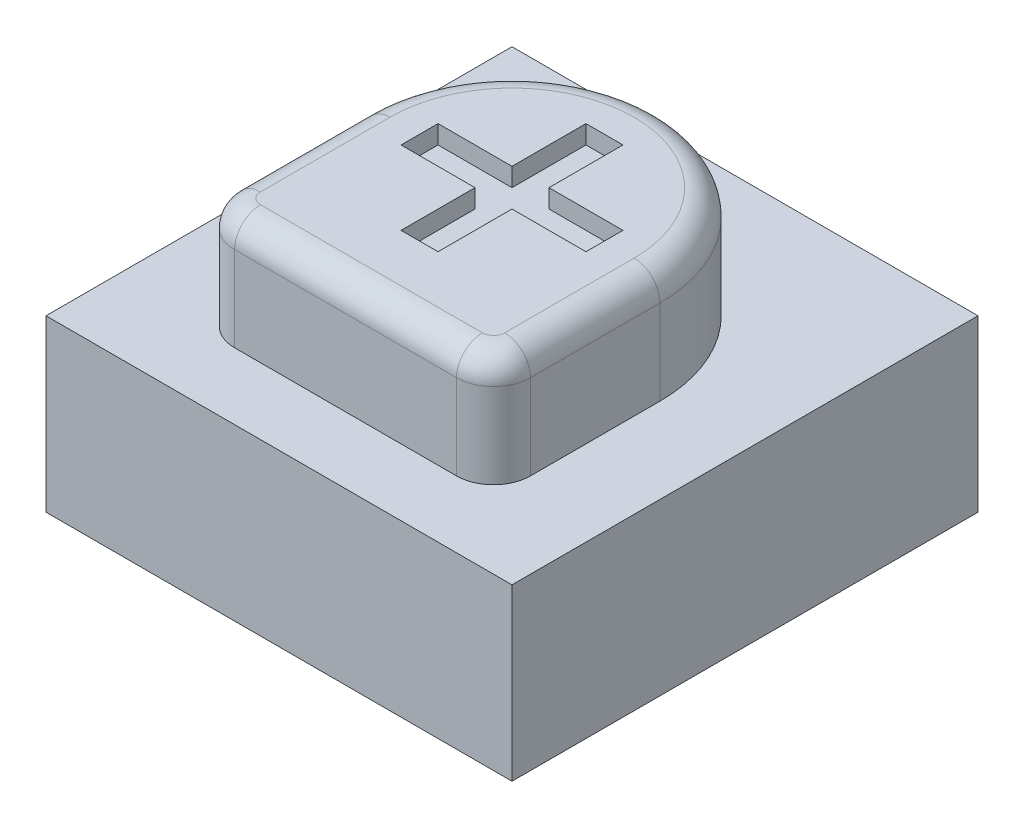
ISO-10303-21;
HEADER;
FILE_DESCRIPTION(('STEP AP214'),'2;1');
FILE_NAME('part.step','',(''),(''),'','','');
FILE_SCHEMA(('AUTOMOTIVE_DESIGN { 1 0 10303 214 1 1 1 1 }'));
ENDSEC;
DATA;
#1=APPLICATION_CONTEXT('core data for automotive mechanical design processes');
#2=APPLICATION_PROTOCOL_DEFINITION('international standard','automotive_design',2000,#1);
#3=PRODUCT_CONTEXT('',#1,'mechanical');
#4=PRODUCT('Part','Part','',(#3));
#5=PRODUCT_RELATED_PRODUCT_CATEGORY('part','',(#4));
#6=PRODUCT_DEFINITION_FORMATION('','',#4);
#7=PRODUCT_DEFINITION_CONTEXT('part definition',#1,'design');
#8=PRODUCT_DEFINITION('design','',#6,#7);
#9=PRODUCT_DEFINITION_SHAPE('','',#8);
#10=(LENGTH_UNIT() NAMED_UNIT(*) SI_UNIT(.MILLI.,.METRE.));
#11=(NAMED_UNIT(*) PLANE_ANGLE_UNIT() SI_UNIT($,.RADIAN.));
#12=(NAMED_UNIT(*) SI_UNIT($,.STERADIAN.) SOLID_ANGLE_UNIT());
#13=UNCERTAINTY_MEASURE_WITH_UNIT(LENGTH_MEASURE(1.E-05),#10,'distance_accuracy_value','');
#14=(GEOMETRIC_REPRESENTATION_CONTEXT(3) GLOBAL_UNCERTAINTY_ASSIGNED_CONTEXT((#13)) GLOBAL_UNIT_ASSIGNED_CONTEXT((#10,
#11,#12)) REPRESENTATION_CONTEXT('',''));
#15=CARTESIAN_POINT('',(0.,0.,0.));
#16=DIRECTION('',(0.,0.,1.));
#17=DIRECTION('',(1.,0.,0.));
#18=AXIS2_PLACEMENT_3D('',#15,#16,#17);
#19=CARTESIAN_POINT('',(-23.37728245926,10.197980609798,-23.63448402181));
#20=DIRECTION('',(0.,-1.,0.));
#21=DIRECTION('',(0.,0.,-1.));
#22=AXIS2_PLACEMENT_3D('',#19,#20,#21);
#23=PLANE('',#22);
#24=DIRECTION('',(-1.,0.,0.));
#25=VECTOR('',#24,1.);
#26=CARTESIAN_POINT('',(-23.37728245926,10.197980609798,-24.63448402181));
#27=LINE('',#26,#25);
#28=CARTESIAN_POINT('',(-23.37728245926,10.197980609798,-24.63448402181));
#29=VERTEX_POINT('',#28);
#30=CARTESIAN_POINT('',(-23.87728245926,10.197980609798,-24.63448402181));
#31=VERTEX_POINT('',#30);
#32=EDGE_CURVE('E438',#29,#31,#27,.T.);
#33=ORIENTED_EDGE('',*,*,#32,.T.);
#34=DIRECTION('',(0.,0.,1.));
#35=VECTOR('',#34,1.);
#36=CARTESIAN_POINT('',(-23.87728245926,10.197980609798,-24.63448402181));
#37=LINE('',#36,#35);
#38=CARTESIAN_POINT('',(-23.87728245926,10.197980609798,-23.63448402181));
#39=VERTEX_POINT('',#38);
#40=EDGE_CURVE('E492',#31,#39,#37,.T.);
#41=ORIENTED_EDGE('',*,*,#40,.T.);
#42=DIRECTION('',(-1.,0.,0.));
#43=VECTOR('',#42,1.);
#44=CARTESIAN_POINT('',(-23.87728245926,10.197980609798,-23.63448402181));
#45=LINE('',#44,#43);
#46=CARTESIAN_POINT('',(-24.87728245926,10.197980609798,-23.63448402181));
#47=VERTEX_POINT('',#46);
#48=EDGE_CURVE('E488',#39,#47,#45,.T.);
#49=ORIENTED_EDGE('',*,*,#48,.T.);
#50=DIRECTION('',(0.,0.,1.));
#51=VECTOR('',#50,1.);
#52=CARTESIAN_POINT('',(-24.87728245926,10.197980609798,-23.13448402181));
#53=LINE('',#52,#51);
#54=CARTESIAN_POINT('',(-24.87728245926,10.197980609798,-23.13448402181));
#55=VERTEX_POINT('',#54);
#56=EDGE_CURVE('E483',#47,#55,#53,.T.);
#57=ORIENTED_EDGE('',*,*,#56,.T.);
#58=DIRECTION('',(1.,0.,0.));
#59=VECTOR('',#58,1.);
#60=CARTESIAN_POINT('',(-23.87728245926,10.197980609798,-23.13448402181));
#61=LINE('',#60,#59);
#62=CARTESIAN_POINT('',(-23.87728245926,10.197980609798,-23.13448402181));
#63=VERTEX_POINT('',#62);
#64=EDGE_CURVE('E478',#55,#63,#61,.T.);
#65=ORIENTED_EDGE('',*,*,#64,.T.);
#66=DIRECTION('',(0.,0.,1.));
#67=VECTOR('',#66,1.);
#68=CARTESIAN_POINT('',(-23.87728245926,10.197980609798,-23.13448402181));
#69=LINE('',#68,#67);
#70=CARTESIAN_POINT('',(-23.87728245926,10.197980609798,-22.13448402181));
#71=VERTEX_POINT('',#70);
#72=EDGE_CURVE('E473',#63,#71,#69,.T.);
#73=ORIENTED_EDGE('',*,*,#72,.T.);
#74=DIRECTION('',(1.,0.,0.));
#75=VECTOR('',#74,1.);
#76=CARTESIAN_POINT('',(-23.37728245926,10.197980609798,-22.13448402181));
#77=LINE('',#76,#75);
#78=CARTESIAN_POINT('',(-23.37728245926,10.197980609798,-22.13448402181));
#79=VERTEX_POINT('',#78);
#80=EDGE_CURVE('E468',#71,#79,#77,.T.);
#81=ORIENTED_EDGE('',*,*,#80,.T.);
#82=DIRECTION('',(0.,0.,-1.));
#83=VECTOR('',#82,1.);
#84=CARTESIAN_POINT('',(-23.37728245926,10.197980609798,-23.13448402181));
#85=LINE('',#84,#83);
#86=CARTESIAN_POINT('',(-23.37728245926,10.197980609798,-23.13448402181));
#87=VERTEX_POINT('',#86);
#88=EDGE_CURVE('E463',#79,#87,#85,.T.);
#89=ORIENTED_EDGE('',*,*,#88,.T.);
#90=DIRECTION('',(1.,0.,0.));
#91=VECTOR('',#90,1.);
#92=CARTESIAN_POINT('',(-22.37728245926,10.197980609798,-23.13448402181));
#93=LINE('',#92,#91);
#94=CARTESIAN_POINT('',(-22.37728245926,10.197980609798,-23.13448402181));
#95=VERTEX_POINT('',#94);
#96=EDGE_CURVE('E458',#87,#95,#93,.T.);
#97=ORIENTED_EDGE('',*,*,#96,.T.);
#98=DIRECTION('',(0.,0.,-1.));
#99=VECTOR('',#98,1.);
#100=CARTESIAN_POINT('',(-22.37728245926,10.197980609798,-23.13448402181));
#101=LINE('',#100,#99);
#102=CARTESIAN_POINT('',(-22.37728245926,10.197980609798,-23.63448402181));
#103=VERTEX_POINT('',#102);
#104=EDGE_CURVE('E453',#95,#103,#101,.T.);
#105=ORIENTED_EDGE('',*,*,#104,.T.);
#106=DIRECTION('',(-1.,0.,0.));
#107=VECTOR('',#106,1.);
#108=CARTESIAN_POINT('',(-22.37728245926,10.197980609798,-23.63448402181));
#109=LINE('',#108,#107);
#110=CARTESIAN_POINT('',(-23.37728245926,10.197980609798,-23.63448402181));
#111=VERTEX_POINT('',#110);
#112=EDGE_CURVE('E448',#103,#111,#109,.T.);
#113=ORIENTED_EDGE('',*,*,#112,.T.);
#114=DIRECTION('',(0.,0.,-1.));
#115=VECTOR('',#114,1.);
#116=CARTESIAN_POINT('',(-23.37728245926,10.197980609798,-24.63448402181));
#117=LINE('',#116,#115);
#118=EDGE_CURVE('E443',#111,#29,#117,.T.);
#119=ORIENTED_EDGE('',*,*,#118,.T.);
#120=EDGE_LOOP('',(#33,#41,#49,#57,#65,#73,#81,#89,#97,#105,#113,#119));
#121=FACE_BOUND('',#120,.T.);
#122=ADVANCED_FACE('F17',(#121),#23,.F.);
#123=CARTESIAN_POINT('',(-23.87728245926,10.197980609798,-24.63448402181));
#124=DIRECTION('',(-1.,0.,0.));
#125=DIRECTION('',(0.,0.,1.));
#126=AXIS2_PLACEMENT_3D('',#123,#124,#125);
#127=PLANE('',#126);
#128=DIRECTION('',(0.,1.,0.));
#129=VECTOR('',#128,1.);
#130=CARTESIAN_POINT('',(-23.87728245926,10.197980609798,-23.63448402181));
#131=LINE('',#130,#129);
#132=CARTESIAN_POINT('',(-23.87728245926,10.447980609798,-23.63448402181));
#133=VERTEX_POINT('',#132);
#134=EDGE_CURVE('E490',#133,#39,#131,.F.);
#135=ORIENTED_EDGE('',*,*,#134,.T.);
#136=ORIENTED_EDGE('',*,*,#40,.F.);
#137=DIRECTION('',(0.,1.,0.));
#138=VECTOR('',#137,1.);
#139=CARTESIAN_POINT('',(-23.87728245926,10.197980609798,-24.63448402181));
#140=LINE('',#139,#138);
#141=CARTESIAN_POINT('',(-23.87728245926,10.447980609798,-24.63448402181));
#142=VERTEX_POINT('',#141);
#143=EDGE_CURVE('E431',#31,#142,#140,.T.);
#144=ORIENTED_EDGE('',*,*,#143,.T.);
#145=DIRECTION('',(0.,0.,-1.));
#146=VECTOR('',#145,1.);
#147=CARTESIAN_POINT('',(-23.87728245926,10.447980609798,-21.63448402181));
#148=LINE('',#147,#146);
#149=EDGE_CURVE('E384',#142,#133,#148,.F.);
#150=ORIENTED_EDGE('',*,*,#149,.T.);
#151=EDGE_LOOP('',(#135,#136,#144,#150));
#152=FACE_BOUND('',#151,.T.);
#153=ADVANCED_FACE('F500',(#152),#127,.F.);
#154=CARTESIAN_POINT('',(-23.87728245926,10.197980609798,-23.63448402181));
#155=DIRECTION('',(0.,0.,-1.));
#156=DIRECTION('',(-1.,0.,0.));
#157=AXIS2_PLACEMENT_3D('',#154,#155,#156);
#158=PLANE('',#157);
#159=DIRECTION('',(0.,1.,0.));
#160=VECTOR('',#159,1.);
#161=CARTESIAN_POINT('',(-24.87728245926,10.197980609798,-23.63448402181));
#162=LINE('',#161,#160);
#163=CARTESIAN_POINT('',(-24.87728245926,10.447980609798,-23.63448402181));
#164=VERTEX_POINT('',#163);
#165=EDGE_CURVE('E485',#164,#47,#162,.F.);
#166=ORIENTED_EDGE('',*,*,#165,.T.);
#167=ORIENTED_EDGE('',*,*,#48,.F.);
#168=ORIENTED_EDGE('',*,*,#134,.F.);
#169=DIRECTION('',(1.,0.,0.));
#170=VECTOR('',#169,1.);
#171=CARTESIAN_POINT('',(-22.12728245926,10.447980609798,-23.63448402181));
#172=LINE('',#171,#170);
#173=EDGE_CURVE('E382',#133,#164,#172,.F.);
#174=ORIENTED_EDGE('',*,*,#173,.T.);
#175=EDGE_LOOP('',(#166,#167,#168,#174));
#176=FACE_BOUND('',#175,.T.);
#177=ADVANCED_FACE('F504',(#176),#158,.F.);
#178=CARTESIAN_POINT('',(-24.87728245926,10.197980609798,-23.13448402181));
#179=DIRECTION('',(-1.,0.,0.));
#180=DIRECTION('',(0.,0.,1.));
#181=AXIS2_PLACEMENT_3D('',#178,#179,#180);
#182=PLANE('',#181);
#183=DIRECTION('',(0.,1.,0.));
#184=VECTOR('',#183,1.);
#185=CARTESIAN_POINT('',(-24.87728245926,10.197980609798,-23.13448402181));
#186=LINE('',#185,#184);
#187=CARTESIAN_POINT('',(-24.87728245926,10.447980609798,-23.13448402181));
#188=VERTEX_POINT('',#187);
#189=EDGE_CURVE('E480',#188,#55,#186,.F.);
#190=ORIENTED_EDGE('',*,*,#189,.T.);
#191=ORIENTED_EDGE('',*,*,#56,.F.);
#192=ORIENTED_EDGE('',*,*,#165,.F.);
#193=DIRECTION('',(0.,0.,-1.));
#194=VECTOR('',#193,1.);
#195=CARTESIAN_POINT('',(-24.87728245926,10.447980609798,-21.63448402181));
#196=LINE('',#195,#194);
#197=EDGE_CURVE('E380',#164,#188,#196,.F.);
#198=ORIENTED_EDGE('',*,*,#197,.T.);
#199=EDGE_LOOP('',(#190,#191,#192,#198));
#200=FACE_BOUND('',#199,.T.);
#201=ADVANCED_FACE('F509',(#200),#182,.F.);
#202=CARTESIAN_POINT('',(-23.87728245926,10.197980609798,-23.13448402181));
#203=DIRECTION('',(0.,0.,1.));
#204=DIRECTION('',(1.,0.,0.));
#205=AXIS2_PLACEMENT_3D('',#202,#203,#204);
#206=PLANE('',#205);
#207=DIRECTION('',(0.,1.,0.));
#208=VECTOR('',#207,1.);
#209=CARTESIAN_POINT('',(-23.87728245926,10.197980609798,-23.13448402181));
#210=LINE('',#209,#208);
#211=CARTESIAN_POINT('',(-23.87728245926,10.447980609798,-23.13448402181));
#212=VERTEX_POINT('',#211);
#213=EDGE_CURVE('E475',#212,#63,#210,.F.);
#214=ORIENTED_EDGE('',*,*,#213,.T.);
#215=ORIENTED_EDGE('',*,*,#64,.F.);
#216=ORIENTED_EDGE('',*,*,#189,.F.);
#217=DIRECTION('',(1.,0.,0.));
#218=VECTOR('',#217,1.);
#219=CARTESIAN_POINT('',(-22.12728245926,10.447980609798,-23.13448402181));
#220=LINE('',#219,#218);
#221=EDGE_CURVE('E378',#188,#212,#220,.T.);
#222=ORIENTED_EDGE('',*,*,#221,.T.);
#223=EDGE_LOOP('',(#214,#215,#216,#222));
#224=FACE_BOUND('',#223,.T.);
#225=ADVANCED_FACE('F515',(#224),#206,.F.);
#226=CARTESIAN_POINT('',(-23.87728245926,10.197980609798,-23.13448402181));
#227=DIRECTION('',(-1.,0.,0.));
#228=DIRECTION('',(0.,0.,1.));
#229=AXIS2_PLACEMENT_3D('',#226,#227,#228);
#230=PLANE('',#229);
#231=DIRECTION('',(0.,1.,0.));
#232=VECTOR('',#231,1.);
#233=CARTESIAN_POINT('',(-23.87728245926,10.197980609798,-22.13448402181));
#234=LINE('',#233,#232);
#235=CARTESIAN_POINT('',(-23.87728245926,10.447980609798,-22.13448402181));
#236=VERTEX_POINT('',#235);
#237=EDGE_CURVE('E470',#236,#71,#234,.F.);
#238=ORIENTED_EDGE('',*,*,#237,.T.);
#239=ORIENTED_EDGE('',*,*,#72,.F.);
#240=ORIENTED_EDGE('',*,*,#213,.F.);
#241=DIRECTION('',(0.,0.,-1.));
#242=VECTOR('',#241,1.);
#243=CARTESIAN_POINT('',(-23.87728245926,10.447980609798,-21.63448402181));
#244=LINE('',#243,#242);
#245=EDGE_CURVE('E376',#212,#236,#244,.F.);
#246=ORIENTED_EDGE('',*,*,#245,.T.);
#247=EDGE_LOOP('',(#238,#239,#240,#246));
#248=FACE_BOUND('',#247,.T.);
#249=ADVANCED_FACE('F519',(#248),#230,.F.);
#250=CARTESIAN_POINT('',(-23.37728245926,10.197980609798,-22.13448402181));
#251=DIRECTION('',(0.,0.,1.));
#252=DIRECTION('',(1.,0.,0.));
#253=AXIS2_PLACEMENT_3D('',#250,#251,#252);
#254=PLANE('',#253);
#255=DIRECTION('',(0.,1.,0.));
#256=VECTOR('',#255,1.);
#257=CARTESIAN_POINT('',(-23.37728245926,10.197980609798,-22.13448402181));
#258=LINE('',#257,#256);
#259=CARTESIAN_POINT('',(-23.37728245926,10.447980609798,-22.13448402181));
#260=VERTEX_POINT('',#259);
#261=EDGE_CURVE('E465',#260,#79,#258,.F.);
#262=ORIENTED_EDGE('',*,*,#261,.T.);
#263=ORIENTED_EDGE('',*,*,#80,.F.);
#264=ORIENTED_EDGE('',*,*,#237,.F.);
#265=DIRECTION('',(1.,0.,0.));
#266=VECTOR('',#265,1.);
#267=CARTESIAN_POINT('',(-22.12728245926,10.447980609798,-22.13448402181));
#268=LINE('',#267,#266);
#269=EDGE_CURVE('E374',#236,#260,#268,.T.);
#270=ORIENTED_EDGE('',*,*,#269,.T.);
#271=EDGE_LOOP('',(#262,#263,#264,#270));
#272=FACE_BOUND('',#271,.T.);
#273=ADVANCED_FACE('F524',(#272),#254,.F.);
#274=CARTESIAN_POINT('',(-23.37728245926,10.197980609798,-23.13448402181));
#275=DIRECTION('',(1.,0.,0.));
#276=DIRECTION('',(0.,0.,-1.));
#277=AXIS2_PLACEMENT_3D('',#274,#275,#276);
#278=PLANE('',#277);
#279=DIRECTION('',(0.,1.,0.));
#280=VECTOR('',#279,1.);
#281=CARTESIAN_POINT('',(-23.37728245926,10.197980609798,-23.13448402181));
#282=LINE('',#281,#280);
#283=CARTESIAN_POINT('',(-23.37728245926,10.447980609798,-23.13448402181));
#284=VERTEX_POINT('',#283);
#285=EDGE_CURVE('E460',#284,#87,#282,.F.);
#286=ORIENTED_EDGE('',*,*,#285,.T.);
#287=ORIENTED_EDGE('',*,*,#88,.F.);
#288=ORIENTED_EDGE('',*,*,#261,.F.);
#289=DIRECTION('',(0.,0.,-1.));
#290=VECTOR('',#289,1.);
#291=CARTESIAN_POINT('',(-23.37728245926,10.447980609798,-21.63448402181));
#292=LINE('',#291,#290);
#293=EDGE_CURVE('E372',#260,#284,#292,.T.);
#294=ORIENTED_EDGE('',*,*,#293,.T.);
#295=EDGE_LOOP('',(#286,#287,#288,#294));
#296=FACE_BOUND('',#295,.T.);
#297=ADVANCED_FACE('F530',(#296),#278,.F.);
#298=CARTESIAN_POINT('',(-22.37728245926,10.197980609798,-23.13448402181));
#299=DIRECTION('',(0.,0.,1.));
#300=DIRECTION('',(1.,0.,0.));
#301=AXIS2_PLACEMENT_3D('',#298,#299,#300);
#302=PLANE('',#301);
#303=DIRECTION('',(0.,1.,0.));
#304=VECTOR('',#303,1.);
#305=CARTESIAN_POINT('',(-22.37728245926,10.197980609798,-23.13448402181));
#306=LINE('',#305,#304);
#307=CARTESIAN_POINT('',(-22.37728245926,10.447980609798,-23.13448402181));
#308=VERTEX_POINT('',#307);
#309=EDGE_CURVE('E455',#308,#95,#306,.F.);
#310=ORIENTED_EDGE('',*,*,#309,.T.);
#311=ORIENTED_EDGE('',*,*,#96,.F.);
#312=ORIENTED_EDGE('',*,*,#285,.F.);
#313=DIRECTION('',(1.,0.,0.));
#314=VECTOR('',#313,1.);
#315=CARTESIAN_POINT('',(-22.12728245926,10.447980609798,-23.13448402181));
#316=LINE('',#315,#314);
#317=EDGE_CURVE('E370',#284,#308,#316,.T.);
#318=ORIENTED_EDGE('',*,*,#317,.T.);
#319=EDGE_LOOP('',(#310,#311,#312,#318));
#320=FACE_BOUND('',#319,.T.);
#321=ADVANCED_FACE('F534',(#320),#302,.F.);
#322=CARTESIAN_POINT('',(-22.37728245926,10.197980609798,-23.13448402181));
#323=DIRECTION('',(1.,0.,0.));
#324=DIRECTION('',(0.,0.,-1.));
#325=AXIS2_PLACEMENT_3D('',#322,#323,#324);
#326=PLANE('',#325);
#327=DIRECTION('',(0.,1.,0.));
#328=VECTOR('',#327,1.);
#329=CARTESIAN_POINT('',(-22.37728245926,10.197980609798,-23.63448402181));
#330=LINE('',#329,#328);
#331=CARTESIAN_POINT('',(-22.37728245926,10.447980609798,-23.63448402181));
#332=VERTEX_POINT('',#331);
#333=EDGE_CURVE('E450',#332,#103,#330,.F.);
#334=ORIENTED_EDGE('',*,*,#333,.T.);
#335=ORIENTED_EDGE('',*,*,#104,.F.);
#336=ORIENTED_EDGE('',*,*,#309,.F.);
#337=DIRECTION('',(0.,0.,-1.));
#338=VECTOR('',#337,1.);
#339=CARTESIAN_POINT('',(-22.37728245926,10.447980609798,-21.63448402181));
#340=LINE('',#339,#338);
#341=EDGE_CURVE('E368',#308,#332,#340,.T.);
#342=ORIENTED_EDGE('',*,*,#341,.T.);
#343=EDGE_LOOP('',(#334,#335,#336,#342));
#344=FACE_BOUND('',#343,.T.);
#345=ADVANCED_FACE('F539',(#344),#326,.F.);
#346=CARTESIAN_POINT('',(-22.37728245926,10.197980609798,-23.63448402181));
#347=DIRECTION('',(0.,0.,-1.));
#348=DIRECTION('',(-1.,0.,0.));
#349=AXIS2_PLACEMENT_3D('',#346,#347,#348);
#350=PLANE('',#349);
#351=DIRECTION('',(0.,1.,0.));
#352=VECTOR('',#351,1.);
#353=CARTESIAN_POINT('',(-23.37728245926,10.197980609798,-23.63448402181));
#354=LINE('',#353,#352);
#355=CARTESIAN_POINT('',(-23.37728245926,10.447980609798,-23.63448402181));
#356=VERTEX_POINT('',#355);
#357=EDGE_CURVE('E445',#356,#111,#354,.F.);
#358=ORIENTED_EDGE('',*,*,#357,.T.);
#359=ORIENTED_EDGE('',*,*,#112,.F.);
#360=ORIENTED_EDGE('',*,*,#333,.F.);
#361=DIRECTION('',(1.,0.,0.));
#362=VECTOR('',#361,1.);
#363=CARTESIAN_POINT('',(-22.12728245926,10.447980609798,-23.63448402181));
#364=LINE('',#363,#362);
#365=EDGE_CURVE('E366',#332,#356,#364,.F.);
#366=ORIENTED_EDGE('',*,*,#365,.T.);
#367=EDGE_LOOP('',(#358,#359,#360,#366));
#368=FACE_BOUND('',#367,.T.);
#369=ADVANCED_FACE('F545',(#368),#350,.F.);
#370=CARTESIAN_POINT('',(-23.37728245926,10.197980609798,-24.63448402181));
#371=DIRECTION('',(1.,0.,0.));
#372=DIRECTION('',(0.,0.,-1.));
#373=AXIS2_PLACEMENT_3D('',#370,#371,#372);
#374=PLANE('',#373);
#375=DIRECTION('',(0.,1.,0.));
#376=VECTOR('',#375,1.);
#377=CARTESIAN_POINT('',(-23.37728245926,10.197980609798,-24.63448402181));
#378=LINE('',#377,#376);
#379=CARTESIAN_POINT('',(-23.37728245926,10.447980609798,-24.63448402181));
#380=VERTEX_POINT('',#379);
#381=EDGE_CURVE('E440',#380,#29,#378,.F.);
#382=ORIENTED_EDGE('',*,*,#381,.T.);
#383=ORIENTED_EDGE('',*,*,#118,.F.);
#384=ORIENTED_EDGE('',*,*,#357,.F.);
#385=DIRECTION('',(0.,0.,-1.));
#386=VECTOR('',#385,1.);
#387=CARTESIAN_POINT('',(-23.37728245926,10.447980609798,-21.63448402181));
#388=LINE('',#387,#386);
#389=EDGE_CURVE('E312',#356,#380,#388,.T.);
#390=ORIENTED_EDGE('',*,*,#389,.T.);
#391=EDGE_LOOP('',(#382,#383,#384,#390));
#392=FACE_BOUND('',#391,.T.);
#393=ADVANCED_FACE('F549',(#392),#374,.F.);
#394=CARTESIAN_POINT('',(-23.37728245926,10.197980609798,-24.63448402181));
#395=DIRECTION('',(0.,0.,-1.));
#396=DIRECTION('',(-1.,0.,0.));
#397=AXIS2_PLACEMENT_3D('',#394,#395,#396);
#398=PLANE('',#397);
#399=ORIENTED_EDGE('',*,*,#143,.F.);
#400=ORIENTED_EDGE('',*,*,#32,.F.);
#401=ORIENTED_EDGE('',*,*,#381,.F.);
#402=DIRECTION('',(1.,0.,0.));
#403=VECTOR('',#402,1.);
#404=CARTESIAN_POINT('',(-22.12728245926,10.447980609798,-24.63448402181));
#405=LINE('',#404,#403);
#406=EDGE_CURVE('E309',#380,#142,#405,.F.);
#407=ORIENTED_EDGE('',*,*,#406,.T.);
#408=EDGE_LOOP('',(#399,#400,#401,#407));
#409=FACE_BOUND('',#408,.T.);
#410=ADVANCED_FACE('F335',(#409),#398,.F.);
#411=CARTESIAN_POINT('',(-22.12728245926,10.447980609798,-21.63448402181));
#412=DIRECTION('',(0.,-1.,0.));
#413=DIRECTION('',(0.,0.,-1.));
#414=AXIS2_PLACEMENT_3D('',#411,#412,#413);
#415=PLANE('',#414);
#416=ORIENTED_EDGE('',*,*,#389,.F.);
#417=ORIENTED_EDGE('',*,*,#365,.F.);
#418=ORIENTED_EDGE('',*,*,#341,.F.);
#419=ORIENTED_EDGE('',*,*,#317,.F.);
#420=ORIENTED_EDGE('',*,*,#293,.F.);
#421=ORIENTED_EDGE('',*,*,#269,.F.);
#422=ORIENTED_EDGE('',*,*,#245,.F.);
#423=ORIENTED_EDGE('',*,*,#221,.F.);
#424=ORIENTED_EDGE('',*,*,#197,.F.);
#425=ORIENTED_EDGE('',*,*,#173,.F.);
#426=ORIENTED_EDGE('',*,*,#149,.F.);
#427=ORIENTED_EDGE('',*,*,#406,.F.);
#428=EDGE_LOOP('',(#416,#417,#418,#419,#420,#421,#422,#423,#424,#425,#426,#427));
#429=FACE_BOUND('',#428,.T.);
#430=CARTESIAN_POINT('',(-25.12728245926,10.447980609798,-21.63448402181));
#431=DIRECTION('',(0.,-1.,0.));
#432=DIRECTION('',(0.,0.,1.));
#433=AXIS2_PLACEMENT_3D('',#430,#431,#432);
#434=CIRCLE('',#433,0.150000000000001);
#435=CARTESIAN_POINT('',(-25.12728245926,10.447980609798,-21.48448402181));
#436=VERTEX_POINT('',#435);
#437=CARTESIAN_POINT('',(-25.27728245926,10.447980609798,-21.63448402181));
#438=VERTEX_POINT('',#437);
#439=EDGE_CURVE('E294',#436,#438,#434,.T.);
#440=ORIENTED_EDGE('',*,*,#439,.F.);
#441=DIRECTION('',(-1.,0.,0.));
#442=VECTOR('',#441,1.);
#443=CARTESIAN_POINT('',(-22.12728245926,10.447980609798,-21.48448402181));
#444=LINE('',#443,#442);
#445=CARTESIAN_POINT('',(-22.12728245926,10.447980609798,-21.48448402181));
#446=VERTEX_POINT('',#445);
#447=EDGE_CURVE('E621',#446,#436,#444,.T.);
#448=ORIENTED_EDGE('',*,*,#447,.F.);
#449=CARTESIAN_POINT('',(-22.12728245926,10.447980609798,-21.63448402181));
#450=DIRECTION('',(0.,-1.,0.));
#451=DIRECTION('',(1.,0.,0.));
#452=AXIS2_PLACEMENT_3D('',#449,#450,#451);
#453=CIRCLE('',#452,0.150000000000001);
#454=CARTESIAN_POINT('',(-21.97728245926,10.447980609798,-21.63448402181));
#455=VERTEX_POINT('',#454);
#456=EDGE_CURVE('E386',#455,#446,#453,.T.);
#457=ORIENTED_EDGE('',*,*,#456,.F.);
#458=DIRECTION('',(0.,0.,1.));
#459=VECTOR('',#458,1.);
#460=CARTESIAN_POINT('',(-21.97728245926,10.447980609798,-21.63448402181));
#461=LINE('',#460,#459);
#462=CARTESIAN_POINT('',(-21.97728245926,10.447980609798,-23.38448402181));
#463=VERTEX_POINT('',#462);
#464=EDGE_CURVE('E194',#463,#455,#461,.T.);
#465=ORIENTED_EDGE('',*,*,#464,.F.);
#466=CARTESIAN_POINT('',(-23.62728245926,10.447980609798,-23.38448402181));
#467=DIRECTION('',(0.,-1.,0.));
#468=DIRECTION('',(0.,0.,-1.));
#469=AXIS2_PLACEMENT_3D('',#466,#467,#468);
#470=CIRCLE('',#469,1.65);
#471=CARTESIAN_POINT('',(-23.62728245926,10.447980609798,-25.03448402181));
#472=VERTEX_POINT('',#471);
#473=EDGE_CURVE('E300',#472,#463,#470,.T.);
#474=ORIENTED_EDGE('',*,*,#473,.F.);
#475=CARTESIAN_POINT('',(-23.62728245926,10.447980609798,-23.38448402181));
#476=DIRECTION('',(0.,-1.,0.));
#477=DIRECTION('',(-1.,0.,0.));
#478=AXIS2_PLACEMENT_3D('',#475,#476,#477);
#479=CIRCLE('',#478,1.65);
#480=CARTESIAN_POINT('',(-25.27728245926,10.447980609798,-23.38448402181));
#481=VERTEX_POINT('',#480);
#482=EDGE_CURVE('E304',#481,#472,#479,.T.);
#483=ORIENTED_EDGE('',*,*,#482,.F.);
#484=DIRECTION('',(0.,0.,-1.));
#485=VECTOR('',#484,1.);
#486=CARTESIAN_POINT('',(-25.27728245926,10.447980609798,-21.63448402181));
#487=LINE('',#486,#485);
#488=EDGE_CURVE('E295',#438,#481,#487,.T.);
#489=ORIENTED_EDGE('',*,*,#488,.F.);
#490=EDGE_LOOP('',(#440,#448,#457,#465,#474,#483,#489));
#491=FACE_BOUND('',#490,.T.);
#492=ADVANCED_FACE('F325',(#429,#491),#415,.F.);
#493=CARTESIAN_POINT('',(-21.97728245926,10.097980609798,-21.63448402181));
#494=DIRECTION('',(0.,0.,1.));
#495=DIRECTION('',(1.,0.,0.));
#496=AXIS2_PLACEMENT_3D('',#493,#494,#495);
#497=CYLINDRICAL_SURFACE('',#496,0.35);
#498=CARTESIAN_POINT('',(-21.97728245926,10.097980609798,-23.38448402181));
#499=DIRECTION('',(0.,0.,1.));
#500=DIRECTION('',(1.,0.,0.));
#501=AXIS2_PLACEMENT_3D('',#498,#499,#500);
#502=CIRCLE('',#501,0.35);
#503=CARTESIAN_POINT('',(-21.62728245926,10.097980609798,-23.38448402181));
#504=VERTEX_POINT('',#503);
#505=EDGE_CURVE('E302',#463,#504,#502,.F.);
#506=ORIENTED_EDGE('',*,*,#505,.F.);
#507=ORIENTED_EDGE('',*,*,#464,.T.);
#508=CARTESIAN_POINT('',(-21.97728245926,10.097980609798,-21.63448402181));
#509=DIRECTION('',(0.,0.,1.));
#510=DIRECTION('',(1.,0.,0.));
#511=AXIS2_PLACEMENT_3D('',#508,#509,#510);
#512=CIRCLE('',#511,0.35);
#513=CARTESIAN_POINT('',(-21.62728245926,10.097980609798,-21.63448402181));
#514=VERTEX_POINT('',#513);
#515=EDGE_CURVE('E188',#514,#455,#512,.T.);
#516=ORIENTED_EDGE('',*,*,#515,.F.);
#517=DIRECTION('',(0.,0.,1.));
#518=VECTOR('',#517,1.);
#519=CARTESIAN_POINT('',(-21.62728245926,10.097980609798,-23.38448402181));
#520=LINE('',#519,#518);
#521=EDGE_CURVE('E192',#514,#504,#520,.F.);
#522=ORIENTED_EDGE('',*,*,#521,.T.);
#523=EDGE_LOOP('',(#506,#507,#516,#522));
#524=FACE_BOUND('',#523,.T.);
#525=ADVANCED_FACE('F191',(#524),#497,.T.);
#526=CARTESIAN_POINT('',(-23.62728245926,10.097980609798,-23.38448402181));
#527=DIRECTION('',(0.,-1.,0.));
#528=DIRECTION('',(0.,0.,-1.));
#529=AXIS2_PLACEMENT_3D('',#526,#527,#528);
#530=TOROIDAL_SURFACE('',#529,1.65,0.35);
#531=CARTESIAN_POINT('',(-23.62728245926,10.097980609798,-23.38448402181));
#532=DIRECTION('',(0.,1.,0.));
#533=DIRECTION('',(0.,0.,1.));
#534=AXIS2_PLACEMENT_3D('',#531,#532,#533);
#535=CIRCLE('',#534,2.);
#536=CARTESIAN_POINT('',(-25.62728245926,10.097980609798,-23.38448402181));
#537=VERTEX_POINT('',#536);
#538=EDGE_CURVE('E243',#537,#504,#535,.F.);
#539=ORIENTED_EDGE('',*,*,#538,.F.);
#540=CARTESIAN_POINT('',(-25.27728245926,10.097980609798,-23.38448402181));
#541=DIRECTION('',(0.,0.,-1.));
#542=DIRECTION('',(-1.,0.,0.));
#543=AXIS2_PLACEMENT_3D('',#540,#541,#542);
#544=CIRCLE('',#543,0.35);
#545=EDGE_CURVE('E411',#481,#537,#544,.F.);
#546=ORIENTED_EDGE('',*,*,#545,.F.);
#547=ORIENTED_EDGE('',*,*,#482,.T.);
#548=ORIENTED_EDGE('',*,*,#473,.T.);
#549=ORIENTED_EDGE('',*,*,#505,.T.);
#550=EDGE_LOOP('',(#539,#546,#547,#548,#549));
#551=FACE_BOUND('',#550,.T.);
#552=ADVANCED_FACE('F301',(#551),#530,.T.);
#553=CARTESIAN_POINT('',(-25.27728245926,10.097980609798,-21.63448402181));
#554=DIRECTION('',(0.,0.,-1.));
#555=DIRECTION('',(-1.,0.,0.));
#556=AXIS2_PLACEMENT_3D('',#553,#554,#555);
#557=CYLINDRICAL_SURFACE('',#556,0.35);
#558=CARTESIAN_POINT('',(-25.27728245926,10.097980609798,-21.63448402181));
#559=DIRECTION('',(0.,0.,-1.));
#560=DIRECTION('',(-1.,0.,0.));
#561=AXIS2_PLACEMENT_3D('',#558,#559,#560);
#562=CIRCLE('',#561,0.35);
#563=CARTESIAN_POINT('',(-25.62728245926,10.097980609798,-21.63448402181));
#564=VERTEX_POINT('',#563);
#565=EDGE_CURVE('E291',#438,#564,#562,.F.);
#566=ORIENTED_EDGE('',*,*,#565,.F.);
#567=ORIENTED_EDGE('',*,*,#488,.T.);
#568=ORIENTED_EDGE('',*,*,#545,.T.);
#569=DIRECTION('',(0.,0.,-1.));
#570=VECTOR('',#569,1.);
#571=CARTESIAN_POINT('',(-25.62728245926,10.097980609798,-21.63448402181));
#572=LINE('',#571,#570);
#573=EDGE_CURVE('E242',#537,#564,#572,.F.);
#574=ORIENTED_EDGE('',*,*,#573,.T.);
#575=EDGE_LOOP('',(#566,#567,#568,#574));
#576=FACE_BOUND('',#575,.T.);
#577=ADVANCED_FACE('F403',(#576),#557,.T.);
#578=CARTESIAN_POINT('',(-25.12728245926,10.447980609798,-21.78448402181));
#579=CARTESIAN_POINT('',(-25.12728245926,10.447980609798,-21.87611380754));
#580=CARTESIAN_POINT('',(-25.12728245926,10.419200919691,-21.96773579706));
#581=CARTESIAN_POINT('',(-25.12728245926,10.361597162172,-22.04810057418));
#582=CARTESIAN_POINT('',(-25.12728245926,10.281232385045,-22.1057043317));
#583=CARTESIAN_POINT('',(-25.12728245926,10.189610395528,-22.13448402181));
#584=CARTESIAN_POINT('',(-25.12728245926,10.097980609798,-22.13448402181));
#585=(BOUNDED_CURVE() B_SPLINE_CURVE(6,(#578,#579,#580,#581,#582,#583,#584),.UNSPECIFIED.,.F.,
.F.) B_SPLINE_CURVE_WITH_KNOTS((7,7),(4.712388980385,6.28318530718),
.UNSPECIFIED.) CURVE() GEOMETRIC_REPRESENTATION_ITEM() RATIONAL_B_SPLINE_CURVE((1.,1.,1.,1.,1.,
1.,1.)) REPRESENTATION_ITEM(''));
#586=CARTESIAN_POINT('',(-25.12728245926,10.097980609798,-21.63448402181));
#587=DIRECTION('',(0.,1.,0.));
#588=AXIS1_PLACEMENT('',#586,#587);
#589=SURFACE_OF_REVOLUTION('',#585,#588);
#590=CARTESIAN_POINT('',(-25.12728245926,10.097980609798,-21.48448402181));
#591=DIRECTION('',(-1.,0.,0.));
#592=DIRECTION('',(0.,0.,1.));
#593=AXIS2_PLACEMENT_3D('',#590,#591,#592);
#594=CIRCLE('',#593,0.35);
#595=CARTESIAN_POINT('',(-25.12728245926,10.097980609798,-21.13448402181));
#596=VERTEX_POINT('',#595);
#597=EDGE_CURVE('E198',#436,#596,#594,.F.);
#598=ORIENTED_EDGE('',*,*,#597,.F.);
#599=ORIENTED_EDGE('',*,*,#439,.T.);
#600=ORIENTED_EDGE('',*,*,#565,.T.);
#601=CARTESIAN_POINT('',(-25.12728245926,10.097980609798,-21.63448402181));
#602=DIRECTION('',(0.,1.,0.));
#603=DIRECTION('',(0.,0.,1.));
#604=AXIS2_PLACEMENT_3D('',#601,#602,#603);
#605=CIRCLE('',#604,0.5);
#606=EDGE_CURVE('E238',#596,#564,#605,.F.);
#607=ORIENTED_EDGE('',*,*,#606,.F.);
#608=EDGE_LOOP('',(#598,#599,#600,#607));
#609=FACE_BOUND('',#608,.T.);
#610=ADVANCED_FACE('F393',(#609),#589,.F.);
#611=CARTESIAN_POINT('',(-22.12728245926,10.097980609798,-21.48448402181));
#612=DIRECTION('',(-1.,0.,0.));
#613=DIRECTION('',(0.,0.,1.));
#614=AXIS2_PLACEMENT_3D('',#611,#612,#613);
#615=CYLINDRICAL_SURFACE('',#614,0.35);
#616=ORIENTED_EDGE('',*,*,#597,.T.);
#617=DIRECTION('',(-1.,0.,0.));
#618=VECTOR('',#617,1.);
#619=CARTESIAN_POINT('',(-22.12728245926,10.097980609798,-21.13448402181));
#620=LINE('',#619,#618);
#621=CARTESIAN_POINT('',(-22.12728245926,10.097980609798,-21.13448402181));
#622=VERTEX_POINT('',#621);
#623=EDGE_CURVE('E224',#596,#622,#620,.F.);
#624=ORIENTED_EDGE('',*,*,#623,.T.);
#625=CARTESIAN_POINT('',(-22.12728245926,10.097980609798,-21.48448402181));
#626=DIRECTION('',(-1.,0.,0.));
#627=DIRECTION('',(0.,0.,1.));
#628=AXIS2_PLACEMENT_3D('',#625,#626,#627);
#629=CIRCLE('',#628,0.35);
#630=EDGE_CURVE('E197',#446,#622,#629,.F.);
#631=ORIENTED_EDGE('',*,*,#630,.F.);
#632=ORIENTED_EDGE('',*,*,#447,.T.);
#633=EDGE_LOOP('',(#616,#624,#631,#632));
#634=FACE_BOUND('',#633,.T.);
#635=ADVANCED_FACE('F263',(#634),#615,.T.);
#636=CARTESIAN_POINT('',(-22.12728245926,10.447980609798,-21.78448402181));
#637=CARTESIAN_POINT('',(-22.12728245926,10.447980609798,-21.87611380754));
#638=CARTESIAN_POINT('',(-22.12728245926,10.419200919691,-21.96773579706));
#639=CARTESIAN_POINT('',(-22.12728245926,10.361597162172,-22.04810057418));
#640=CARTESIAN_POINT('',(-22.12728245926,10.281232385045,-22.1057043317));
#641=CARTESIAN_POINT('',(-22.12728245926,10.189610395528,-22.13448402181));
#642=CARTESIAN_POINT('',(-22.12728245926,10.097980609798,-22.13448402181));
#643=(BOUNDED_CURVE() B_SPLINE_CURVE(6,(#636,#637,#638,#639,#640,#641,#642),.UNSPECIFIED.,.F.,
.F.) B_SPLINE_CURVE_WITH_KNOTS((7,7),(4.712388980385,6.28318530718),
.UNSPECIFIED.) CURVE() GEOMETRIC_REPRESENTATION_ITEM() RATIONAL_B_SPLINE_CURVE((1.,1.,1.,1.,1.,
1.,1.)) REPRESENTATION_ITEM(''));
#644=CARTESIAN_POINT('',(-22.12728245926,10.097980609798,-21.63448402181));
#645=DIRECTION('',(0.,1.,0.));
#646=AXIS1_PLACEMENT('',#644,#645);
#647=SURFACE_OF_REVOLUTION('',#643,#646);
#648=ORIENTED_EDGE('',*,*,#630,.T.);
#649=CARTESIAN_POINT('',(-22.12728245926,10.097980609798,-21.63448402181));
#650=DIRECTION('',(0.,1.,0.));
#651=DIRECTION('',(0.,0.,1.));
#652=AXIS2_PLACEMENT_3D('',#649,#650,#651);
#653=CIRCLE('',#652,0.5);
#654=EDGE_CURVE('E212',#514,#622,#653,.F.);
#655=ORIENTED_EDGE('',*,*,#654,.F.);
#656=ORIENTED_EDGE('',*,*,#515,.T.);
#657=ORIENTED_EDGE('',*,*,#456,.T.);
#658=EDGE_LOOP('',(#648,#655,#656,#657));
#659=FACE_BOUND('',#658,.T.);
#660=ADVANCED_FACE('F213',(#659),#647,.F.);
#661=CARTESIAN_POINT('',(-21.62728245926,10.447980609798,-23.38448402181));
#662=DIRECTION('',(-1.,0.,0.));
#663=DIRECTION('',(0.,0.,1.));
#664=AXIS2_PLACEMENT_3D('',#661,#662,#663);
#665=PLANE('',#664);
#666=ORIENTED_EDGE('',*,*,#521,.F.);
#667=DIRECTION('',(0.,1.,0.));
#668=VECTOR('',#667,1.);
#669=CARTESIAN_POINT('',(-21.62728245926,10.447980609798,-21.63448402181));
#670=LINE('',#669,#668);
#671=CARTESIAN_POINT('',(-21.62728245926,8.947980609798,-21.63448402181));
#672=VERTEX_POINT('',#671);
#673=EDGE_CURVE('E205',#672,#514,#670,.T.);
#674=ORIENTED_EDGE('',*,*,#673,.F.);
#675=DIRECTION('',(0.,0.,-1.));
#676=VECTOR('',#675,1.);
#677=CARTESIAN_POINT('',(-21.62728245926,8.947980609798,-26.53448402181));
#678=LINE('',#677,#676);
#679=CARTESIAN_POINT('',(-21.62728245926,8.947980609798,-23.38448402181));
#680=VERTEX_POINT('',#679);
#681=EDGE_CURVE('E285',#672,#680,#678,.T.);
#682=ORIENTED_EDGE('',*,*,#681,.T.);
#683=DIRECTION('',(0.,1.,0.));
#684=VECTOR('',#683,1.);
#685=CARTESIAN_POINT('',(-21.62728245926,10.447980609798,-23.38448402181));
#686=LINE('',#685,#684);
#687=EDGE_CURVE('E208',#504,#680,#686,.F.);
#688=ORIENTED_EDGE('',*,*,#687,.F.);
#689=EDGE_LOOP('',(#666,#674,#682,#688));
#690=FACE_BOUND('',#689,.T.);
#691=ADVANCED_FACE('F202',(#690),#665,.F.);
#692=CARTESIAN_POINT('',(-23.62728245926,10.447980609798,-23.38448402181));
#693=DIRECTION('',(0.,1.,0.));
#694=DIRECTION('',(0.,0.,1.));
#695=AXIS2_PLACEMENT_3D('',#692,#693,#694);
#696=CYLINDRICAL_SURFACE('',#695,2.);
#697=CARTESIAN_POINT('',(-23.62728245926,8.947980609798,-23.38448402181));
#698=DIRECTION('',(0.,1.,0.));
#699=DIRECTION('',(0.,0.,1.));
#700=AXIS2_PLACEMENT_3D('',#697,#698,#699);
#701=CIRCLE('',#700,2.);
#702=CARTESIAN_POINT('',(-25.62728245926,8.947980609798,-23.38448402181));
#703=VERTEX_POINT('',#702);
#704=EDGE_CURVE('E283',#680,#703,#701,.T.);
#705=ORIENTED_EDGE('',*,*,#704,.T.);
#706=DIRECTION('',(0.,1.,0.));
#707=VECTOR('',#706,1.);
#708=CARTESIAN_POINT('',(-25.62728245926,10.447980609798,-23.38448402181));
#709=LINE('',#708,#707);
#710=EDGE_CURVE('E239',#703,#537,#709,.T.);
#711=ORIENTED_EDGE('',*,*,#710,.T.);
#712=ORIENTED_EDGE('',*,*,#538,.T.);
#713=ORIENTED_EDGE('',*,*,#687,.T.);
#714=EDGE_LOOP('',(#705,#711,#712,#713));
#715=FACE_BOUND('',#714,.T.);
#716=ADVANCED_FACE('F597',(#715),#696,.T.);
#717=CARTESIAN_POINT('',(-25.62728245926,10.447980609798,-21.63448402181));
#718=DIRECTION('',(1.,0.,0.));
#719=DIRECTION('',(0.,0.,-1.));
#720=AXIS2_PLACEMENT_3D('',#717,#718,#719);
#721=PLANE('',#720);
#722=ORIENTED_EDGE('',*,*,#573,.F.);
#723=ORIENTED_EDGE('',*,*,#710,.F.);
#724=DIRECTION('',(0.,0.,-1.));
#725=VECTOR('',#724,1.);
#726=CARTESIAN_POINT('',(-25.62728245926,8.947980609798,-26.53448402181));
#727=LINE('',#726,#725);
#728=CARTESIAN_POINT('',(-25.62728245926,8.947980609798,-21.63448402181));
#729=VERTEX_POINT('',#728);
#730=EDGE_CURVE('E282',#703,#729,#727,.F.);
#731=ORIENTED_EDGE('',*,*,#730,.T.);
#732=DIRECTION('',(0.,1.,0.));
#733=VECTOR('',#732,1.);
#734=CARTESIAN_POINT('',(-25.62728245926,10.447980609798,-21.63448402181));
#735=LINE('',#734,#733);
#736=EDGE_CURVE('E233',#564,#729,#735,.F.);
#737=ORIENTED_EDGE('',*,*,#736,.F.);
#738=EDGE_LOOP('',(#722,#723,#731,#737));
#739=FACE_BOUND('',#738,.T.);
#740=ADVANCED_FACE('F594',(#739),#721,.F.);
#741=CARTESIAN_POINT('',(-25.12728245926,10.447980609798,-21.63448402181));
#742=DIRECTION('',(0.,1.,0.));
#743=DIRECTION('',(0.,0.,1.));
#744=AXIS2_PLACEMENT_3D('',#741,#742,#743);
#745=CYLINDRICAL_SURFACE('',#744,0.5);
#746=ORIENTED_EDGE('',*,*,#736,.T.);
#747=CARTESIAN_POINT('',(-25.12728245926,8.947980609798,-21.63448402181));
#748=DIRECTION('',(0.,1.,0.));
#749=DIRECTION('',(0.,0.,1.));
#750=AXIS2_PLACEMENT_3D('',#747,#748,#749);
#751=CIRCLE('',#750,0.5);
#752=CARTESIAN_POINT('',(-25.12728245926,8.947980609798,-21.13448402181));
#753=VERTEX_POINT('',#752);
#754=EDGE_CURVE('E280',#729,#753,#751,.T.);
#755=ORIENTED_EDGE('',*,*,#754,.T.);
#756=DIRECTION('',(0.,1.,0.));
#757=VECTOR('',#756,1.);
#758=CARTESIAN_POINT('',(-25.12728245926,10.447980609798,-21.13448402181));
#759=LINE('',#758,#757);
#760=EDGE_CURVE('E226',#753,#596,#759,.T.);
#761=ORIENTED_EDGE('',*,*,#760,.T.);
#762=ORIENTED_EDGE('',*,*,#606,.T.);
#763=EDGE_LOOP('',(#746,#755,#761,#762));
#764=FACE_BOUND('',#763,.T.);
#765=ADVANCED_FACE('F590',(#764),#745,.T.);
#766=CARTESIAN_POINT('',(-22.12728245926,10.447980609798,-21.13448402181));
#767=DIRECTION('',(0.,0.,-1.));
#768=DIRECTION('',(-1.,0.,0.));
#769=AXIS2_PLACEMENT_3D('',#766,#767,#768);
#770=PLANE('',#769);
#771=ORIENTED_EDGE('',*,*,#623,.F.);
#772=ORIENTED_EDGE('',*,*,#760,.F.);
#773=DIRECTION('',(1.,0.,0.));
#774=VECTOR('',#773,1.);
#775=CARTESIAN_POINT('',(-26.77728245926,8.947980609798,-21.13448402181));
#776=LINE('',#775,#774);
#777=CARTESIAN_POINT('',(-22.12728245926,8.947980609798,-21.13448402181));
#778=VERTEX_POINT('',#777);
#779=EDGE_CURVE('E279',#753,#778,#776,.T.);
#780=ORIENTED_EDGE('',*,*,#779,.T.);
#781=DIRECTION('',(0.,1.,0.));
#782=VECTOR('',#781,1.);
#783=CARTESIAN_POINT('',(-22.12728245926,10.447980609798,-21.13448402181));
#784=LINE('',#783,#782);
#785=EDGE_CURVE('E218',#622,#778,#784,.F.);
#786=ORIENTED_EDGE('',*,*,#785,.F.);
#787=EDGE_LOOP('',(#771,#772,#780,#786));
#788=FACE_BOUND('',#787,.T.);
#789=ADVANCED_FACE('F587',(#788),#770,.F.);
#790=CARTESIAN_POINT('',(-22.12728245926,10.447980609798,-21.63448402181));
#791=DIRECTION('',(0.,1.,0.));
#792=DIRECTION('',(0.,0.,1.));
#793=AXIS2_PLACEMENT_3D('',#790,#791,#792);
#794=CYLINDRICAL_SURFACE('',#793,0.5);
#795=ORIENTED_EDGE('',*,*,#785,.T.);
#796=CARTESIAN_POINT('',(-22.12728245926,8.947980609798,-21.63448402181));
#797=DIRECTION('',(0.,1.,0.));
#798=DIRECTION('',(0.,0.,1.));
#799=AXIS2_PLACEMENT_3D('',#796,#797,#798);
#800=CIRCLE('',#799,0.5);
#801=EDGE_CURVE('E222',#778,#672,#800,.T.);
#802=ORIENTED_EDGE('',*,*,#801,.T.);
#803=ORIENTED_EDGE('',*,*,#673,.T.);
#804=ORIENTED_EDGE('',*,*,#654,.T.);
#805=EDGE_LOOP('',(#795,#802,#803,#804));
#806=FACE_BOUND('',#805,.T.);
#807=ADVANCED_FACE('F220',(#806),#794,.T.);
#808=CARTESIAN_POINT('',(-26.77728245926,8.947980609798,-26.53448402181));
#809=DIRECTION('',(0.,-1.,0.));
#810=DIRECTION('',(0.,0.,-1.));
#811=AXIS2_PLACEMENT_3D('',#808,#809,#810);
#812=PLANE('',#811);
#813=ORIENTED_EDGE('',*,*,#779,.F.);
#814=ORIENTED_EDGE('',*,*,#754,.F.);
#815=ORIENTED_EDGE('',*,*,#730,.F.);
#816=ORIENTED_EDGE('',*,*,#704,.F.);
#817=ORIENTED_EDGE('',*,*,#681,.F.);
#818=ORIENTED_EDGE('',*,*,#801,.F.);
#819=EDGE_LOOP('',(#813,#814,#815,#816,#817,#818));
#820=FACE_BOUND('',#819,.T.);
#821=DIRECTION('',(-1.,0.,0.));
#822=VECTOR('',#821,1.);
#823=CARTESIAN_POINT('',(-26.77728245926,8.947980609798,-20.23448402181));
#824=LINE('',#823,#822);
#825=CARTESIAN_POINT('',(-26.77728245926,8.947980609798,-20.23448402181));
#826=VERTEX_POINT('',#825);
#827=CARTESIAN_POINT('',(-20.47728245926,8.947980609798,-20.23448402181));
#828=VERTEX_POINT('',#827);
#829=EDGE_CURVE('E900',#826,#828,#824,.F.);
#830=ORIENTED_EDGE('',*,*,#829,.T.);
#831=DIRECTION('',(0.,0.,1.));
#832=VECTOR('',#831,1.);
#833=CARTESIAN_POINT('',(-20.47728245926,8.947980609798,-20.23448402181));
#834=LINE('',#833,#832);
#835=CARTESIAN_POINT('',(-20.47728245926,8.947980609798,-26.53448402181));
#836=VERTEX_POINT('',#835);
#837=EDGE_CURVE('E893',#828,#836,#834,.F.);
#838=ORIENTED_EDGE('',*,*,#837,.T.);
#839=DIRECTION('',(1.,0.,0.));
#840=VECTOR('',#839,1.);
#841=CARTESIAN_POINT('',(-26.77728245926,8.947980609798,-26.53448402181));
#842=LINE('',#841,#840);
#843=CARTESIAN_POINT('',(-26.77728245926,8.947980609798,-26.53448402181));
#844=VERTEX_POINT('',#843);
#845=EDGE_CURVE('E889',#836,#844,#842,.F.);
#846=ORIENTED_EDGE('',*,*,#845,.T.);
#847=DIRECTION('',(0.,0.,-1.));
#848=VECTOR('',#847,1.);
#849=CARTESIAN_POINT('',(-26.77728245926,8.947980609798,-20.23448402181));
#850=LINE('',#849,#848);
#851=EDGE_CURVE('E278',#844,#826,#850,.F.);
#852=ORIENTED_EDGE('',*,*,#851,.T.);
#853=EDGE_LOOP('',(#830,#838,#846,#852));
#854=FACE_BOUND('',#853,.T.);
#855=ADVANCED_FACE('F580',(#820,#854),#812,.F.);
#856=CARTESIAN_POINT('',(-26.77728245926,8.947980609798,-20.23448402181));
#857=DIRECTION('',(1.,0.,0.));
#858=DIRECTION('',(0.,0.,-1.));
#859=AXIS2_PLACEMENT_3D('',#856,#857,#858);
#860=PLANE('',#859);
#861=DIRECTION('',(0.,1.,0.));
#862=VECTOR('',#861,1.);
#863=CARTESIAN_POINT('',(-26.77728245926,8.947980609798,-20.23448402181));
#864=LINE('',#863,#862);
#865=CARTESIAN_POINT('',(-26.77728245926,6.647980609798,-20.23448402181));
#866=VERTEX_POINT('',#865);
#867=EDGE_CURVE('E897',#866,#826,#864,.T.);
#868=ORIENTED_EDGE('',*,*,#867,.T.);
#869=ORIENTED_EDGE('',*,*,#851,.F.);
#870=DIRECTION('',(0.,1.,0.));
#871=VECTOR('',#870,1.);
#872=CARTESIAN_POINT('',(-26.77728245926,8.947980609798,-26.53448402181));
#873=LINE('',#872,#871);
#874=CARTESIAN_POINT('',(-26.77728245926,6.647980609798,-26.53448402181));
#875=VERTEX_POINT('',#874);
#876=EDGE_CURVE('E891',#844,#875,#873,.F.);
#877=ORIENTED_EDGE('',*,*,#876,.T.);
#878=DIRECTION('',(0.,0.,-1.));
#879=VECTOR('',#878,1.);
#880=CARTESIAN_POINT('',(-26.77728245926,6.647980609798,-26.53448402181));
#881=LINE('',#880,#879);
#882=EDGE_CURVE('E903',#866,#875,#881,.T.);
#883=ORIENTED_EDGE('',*,*,#882,.F.);
#884=EDGE_LOOP('',(#868,#869,#877,#883));
#885=FACE_BOUND('',#884,.T.);
#886=ADVANCED_FACE('F576',(#885),#860,.F.);
#887=CARTESIAN_POINT('',(-26.77728245926,8.947980609798,-26.53448402181));
#888=DIRECTION('',(0.,0.,1.));
#889=DIRECTION('',(1.,0.,0.));
#890=AXIS2_PLACEMENT_3D('',#887,#888,#889);
#891=PLANE('',#890);
#892=ORIENTED_EDGE('',*,*,#876,.F.);
#893=ORIENTED_EDGE('',*,*,#845,.F.);
#894=DIRECTION('',(0.,1.,0.));
#895=VECTOR('',#894,1.);
#896=CARTESIAN_POINT('',(-20.47728245926,8.947980609798,-26.53448402181));
#897=LINE('',#896,#895);
#898=CARTESIAN_POINT('',(-20.47728245926,6.647980609798,-26.53448402181));
#899=VERTEX_POINT('',#898);
#900=EDGE_CURVE('E895',#836,#899,#897,.F.);
#901=ORIENTED_EDGE('',*,*,#900,.T.);
#902=DIRECTION('',(1.,0.,0.));
#903=VECTOR('',#902,1.);
#904=CARTESIAN_POINT('',(-26.77728245926,6.647980609798,-26.53448402181));
#905=LINE('',#904,#903);
#906=EDGE_CURVE('E906',#875,#899,#905,.T.);
#907=ORIENTED_EDGE('',*,*,#906,.F.);
#908=EDGE_LOOP('',(#892,#893,#901,#907));
#909=FACE_BOUND('',#908,.T.);
#910=ADVANCED_FACE('F573',(#909),#891,.F.);
#911=CARTESIAN_POINT('',(-20.47728245926,8.947980609798,-20.23448402181));
#912=DIRECTION('',(-1.,0.,0.));
#913=DIRECTION('',(0.,0.,1.));
#914=AXIS2_PLACEMENT_3D('',#911,#912,#913);
#915=PLANE('',#914);
#916=ORIENTED_EDGE('',*,*,#900,.F.);
#917=ORIENTED_EDGE('',*,*,#837,.F.);
#918=DIRECTION('',(0.,1.,0.));
#919=VECTOR('',#918,1.);
#920=CARTESIAN_POINT('',(-20.47728245926,8.947980609798,-20.23448402181));
#921=LINE('',#920,#919);
#922=CARTESIAN_POINT('',(-20.47728245926,6.647980609798,-20.23448402181));
#923=VERTEX_POINT('',#922);
#924=EDGE_CURVE('E37',#828,#923,#921,.F.);
#925=ORIENTED_EDGE('',*,*,#924,.T.);
#926=DIRECTION('',(0.,0.,-1.));
#927=VECTOR('',#926,1.);
#928=CARTESIAN_POINT('',(-20.47728245926,6.647980609798,-26.53448402181));
#929=LINE('',#928,#927);
#930=EDGE_CURVE('E28',#899,#923,#929,.F.);
#931=ORIENTED_EDGE('',*,*,#930,.F.);
#932=EDGE_LOOP('',(#916,#917,#925,#931));
#933=FACE_BOUND('',#932,.T.);
#934=ADVANCED_FACE('F566',(#933),#915,.F.);
#935=CARTESIAN_POINT('',(-26.77728245926,8.947980609798,-20.23448402181));
#936=DIRECTION('',(0.,0.,-1.));
#937=DIRECTION('',(-1.,0.,0.));
#938=AXIS2_PLACEMENT_3D('',#935,#936,#937);
#939=PLANE('',#938);
#940=ORIENTED_EDGE('',*,*,#924,.F.);
#941=ORIENTED_EDGE('',*,*,#829,.F.);
#942=ORIENTED_EDGE('',*,*,#867,.F.);
#943=DIRECTION('',(1.,0.,0.));
#944=VECTOR('',#943,1.);
#945=CARTESIAN_POINT('',(-26.77728245926,6.647980609798,-20.23448402181));
#946=LINE('',#945,#944);
#947=EDGE_CURVE('E11',#923,#866,#946,.F.);
#948=ORIENTED_EDGE('',*,*,#947,.F.);
#949=EDGE_LOOP('',(#940,#941,#942,#948));
#950=FACE_BOUND('',#949,.T.);
#951=ADVANCED_FACE('F560',(#950),#939,.F.);
#952=CARTESIAN_POINT('',(-26.77728245926,6.647980609798,-26.53448402181));
#953=DIRECTION('',(0.,-1.,0.));
#954=DIRECTION('',(0.,0.,-1.));
#955=AXIS2_PLACEMENT_3D('',#952,#953,#954);
#956=PLANE('',#955);
#957=ORIENTED_EDGE('',*,*,#930,.T.);
#958=ORIENTED_EDGE('',*,*,#947,.T.);
#959=ORIENTED_EDGE('',*,*,#882,.T.);
#960=ORIENTED_EDGE('',*,*,#906,.T.);
#961=EDGE_LOOP('',(#957,#958,#959,#960));
#962=FACE_BOUND('',#961,.T.);
#963=ADVANCED_FACE('F558',(#962),#956,.T.);
#964=CLOSED_SHELL('',(#122,#153,#177,#201,#225,#249,#273,#297,#321,#345,#369,#393,#410,#492,
#525,#552,#577,#610,#635,#660,#691,#716,#740,#765,#789,#807,#855,#886,#910,#934,#951,#963));
#965=MANIFOLD_SOLID_BREP('B1',#964);
#966=ADVANCED_BREP_SHAPE_REPRESENTATION('',(#18,#965),#14);
#967=SHAPE_DEFINITION_REPRESENTATION(#9,#966);
ENDSEC;
END-ISO-10303-21;
